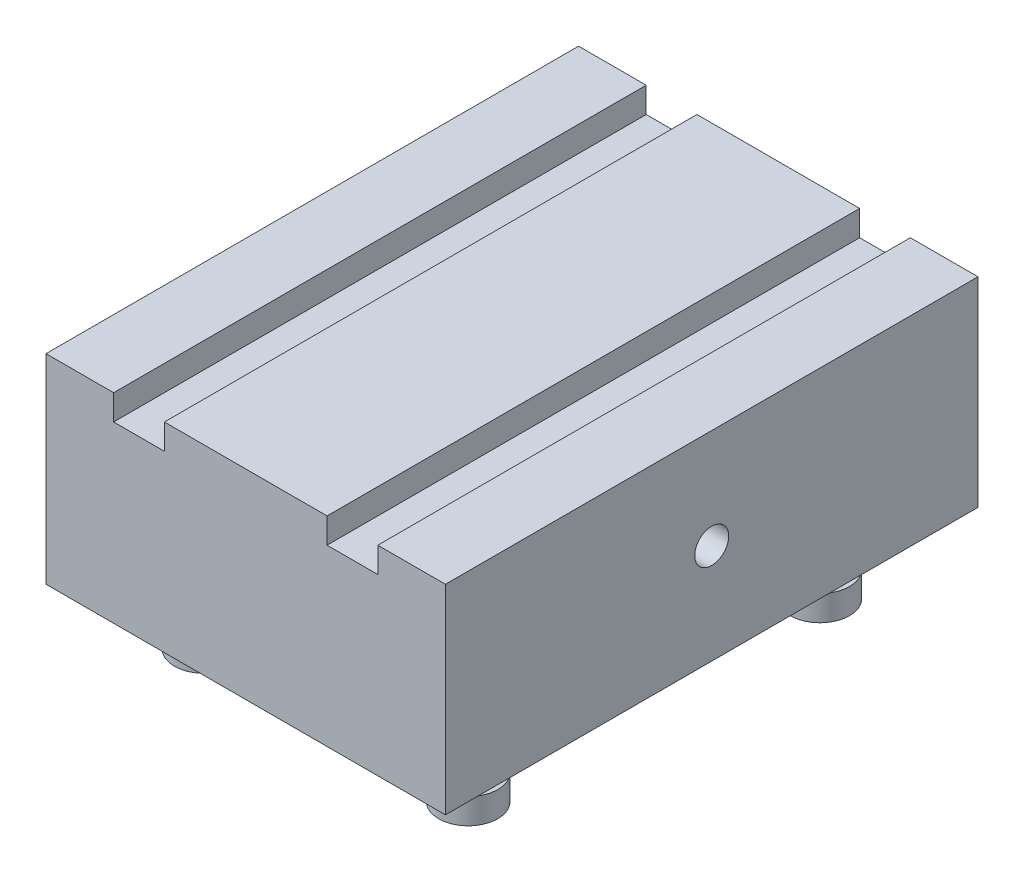
ISO-10303-21;
HEADER;
FILE_DESCRIPTION(('STEP AP214'),'2;1');
FILE_NAME('part.step','',(''),(''),'','','');
FILE_SCHEMA(('AUTOMOTIVE_DESIGN { 1 0 10303 214 1 1 1 1 }'));
ENDSEC;
DATA;
#1=APPLICATION_CONTEXT('core data for automotive mechanical design processes');
#2=APPLICATION_PROTOCOL_DEFINITION('international standard','automotive_design',2000,#1);
#3=PRODUCT_CONTEXT('',#1,'mechanical');
#4=PRODUCT('Part','Part','',(#3));
#5=PRODUCT_RELATED_PRODUCT_CATEGORY('part','',(#4));
#6=PRODUCT_DEFINITION_FORMATION('','',#4);
#7=PRODUCT_DEFINITION_CONTEXT('part definition',#1,'design');
#8=PRODUCT_DEFINITION('design','',#6,#7);
#9=PRODUCT_DEFINITION_SHAPE('','',#8);
#10=(LENGTH_UNIT() NAMED_UNIT(*) SI_UNIT(.MILLI.,.METRE.));
#11=(NAMED_UNIT(*) PLANE_ANGLE_UNIT() SI_UNIT($,.RADIAN.));
#12=(NAMED_UNIT(*) SI_UNIT($,.STERADIAN.) SOLID_ANGLE_UNIT());
#13=UNCERTAINTY_MEASURE_WITH_UNIT(LENGTH_MEASURE(1.E-05),#10,'distance_accuracy_value','');
#14=(GEOMETRIC_REPRESENTATION_CONTEXT(3) GLOBAL_UNCERTAINTY_ASSIGNED_CONTEXT((#13)) GLOBAL_UNIT_ASSIGNED_CONTEXT((#10,
#11,#12)) REPRESENTATION_CONTEXT('',''));
#15=CARTESIAN_POINT('',(0.,0.,0.));
#16=DIRECTION('',(0.,0.,1.));
#17=DIRECTION('',(1.,0.,0.));
#18=AXIS2_PLACEMENT_3D('',#15,#16,#17);
#19=CARTESIAN_POINT('',(0.,-30.,0.));
#20=DIRECTION('',(0.,0.,1.));
#21=DIRECTION('',(1.,0.,0.));
#22=AXIS2_PLACEMENT_3D('',#19,#20,#21);
#23=PLANE('',#22);
#24=DIRECTION('',(0.,-1.,0.));
#25=VECTOR('',#24,1.);
#26=CARTESIAN_POINT('',(10.16,0.,0.));
#27=LINE('',#26,#25);
#28=CARTESIAN_POINT('',(10.16,0.,0.));
#29=VERTEX_POINT('',#28);
#30=CARTESIAN_POINT('',(10.16,-3.81,0.));
#31=VERTEX_POINT('',#30);
#32=EDGE_CURVE('E150',#29,#31,#27,.T.);
#33=ORIENTED_EDGE('',*,*,#32,.F.);
#34=DIRECTION('',(1.,0.,0.));
#35=VECTOR('',#34,1.);
#36=CARTESIAN_POINT('',(0.,0.,0.));
#37=LINE('',#36,#35);
#38=CARTESIAN_POINT('',(0.,0.,0.));
#39=VERTEX_POINT('',#38);
#40=EDGE_CURVE('E202',#39,#29,#37,.T.);
#41=ORIENTED_EDGE('',*,*,#40,.F.);
#42=DIRECTION('',(0.,1.,0.));
#43=VECTOR('',#42,1.);
#44=CARTESIAN_POINT('',(0.,-30.,0.));
#45=LINE('',#44,#43);
#46=CARTESIAN_POINT('',(0.,-30.,0.));
#47=VERTEX_POINT('',#46);
#48=EDGE_CURVE('E214',#47,#39,#45,.T.);
#49=ORIENTED_EDGE('',*,*,#48,.F.);
#50=DIRECTION('',(1.,0.,0.));
#51=VECTOR('',#50,1.);
#52=CARTESIAN_POINT('',(0.,-30.,0.));
#53=LINE('',#52,#51);
#54=CARTESIAN_POINT('',(59.999999888,-30.,0.));
#55=VERTEX_POINT('',#54);
#56=EDGE_CURVE('E190',#47,#55,#53,.T.);
#57=ORIENTED_EDGE('',*,*,#56,.T.);
#58=DIRECTION('',(0.,1.,0.));
#59=VECTOR('',#58,1.);
#60=CARTESIAN_POINT('',(59.999999888,-30.,0.));
#61=LINE('',#60,#59);
#62=CARTESIAN_POINT('',(59.999999888,0.,0.));
#63=VERTEX_POINT('',#62);
#64=EDGE_CURVE('E201',#55,#63,#61,.T.);
#65=ORIENTED_EDGE('',*,*,#64,.T.);
#66=CARTESIAN_POINT('',(49.839999888,0.,0.));
#67=VERTEX_POINT('',#66);
#68=EDGE_CURVE('E164',#67,#63,#37,.T.);
#69=ORIENTED_EDGE('',*,*,#68,.F.);
#70=DIRECTION('',(0.,-1.,0.));
#71=VECTOR('',#70,1.);
#72=CARTESIAN_POINT('',(49.839999888,0.,0.));
#73=LINE('',#72,#71);
#74=CARTESIAN_POINT('',(49.839999888,-3.80999999999999,0.));
#75=VERTEX_POINT('',#74);
#76=EDGE_CURVE('E170',#67,#75,#73,.T.);
#77=ORIENTED_EDGE('',*,*,#76,.T.);
#78=DIRECTION('',(-1.,0.,0.));
#79=VECTOR('',#78,1.);
#80=CARTESIAN_POINT('',(0.,-3.81000000000001,0.));
#81=LINE('',#80,#79);
#82=CARTESIAN_POINT('',(42.219999888,-3.80999999999999,0.));
#83=VERTEX_POINT('',#82);
#84=EDGE_CURVE('E178',#75,#83,#81,.T.);
#85=ORIENTED_EDGE('',*,*,#84,.T.);
#86=DIRECTION('',(0.,1.,0.));
#87=VECTOR('',#86,1.);
#88=CARTESIAN_POINT('',(42.219999888,0.,0.));
#89=LINE('',#88,#87);
#90=CARTESIAN_POINT('',(42.219999888,0.,0.));
#91=VERTEX_POINT('',#90);
#92=EDGE_CURVE('E175',#83,#91,#89,.T.);
#93=ORIENTED_EDGE('',*,*,#92,.T.);
#94=CARTESIAN_POINT('',(17.78,0.,0.));
#95=VERTEX_POINT('',#94);
#96=EDGE_CURVE('E206',#95,#91,#37,.T.);
#97=ORIENTED_EDGE('',*,*,#96,.F.);
#98=DIRECTION('',(0.,1.,0.));
#99=VECTOR('',#98,1.);
#100=CARTESIAN_POINT('',(17.78,0.,0.));
#101=LINE('',#100,#99);
#102=CARTESIAN_POINT('',(17.78,-3.81,0.));
#103=VERTEX_POINT('',#102);
#104=EDGE_CURVE('E63',#103,#95,#101,.T.);
#105=ORIENTED_EDGE('',*,*,#104,.F.);
#106=DIRECTION('',(1.,0.,0.));
#107=VECTOR('',#106,1.);
#108=CARTESIAN_POINT('',(0.,-3.81,0.));
#109=LINE('',#108,#107);
#110=EDGE_CURVE('E137',#31,#103,#109,.T.);
#111=ORIENTED_EDGE('',*,*,#110,.F.);
#112=EDGE_LOOP('',(#33,#41,#49,#57,#65,#69,#77,#85,#93,#97,#105,#111));
#113=FACE_BOUND('',#112,.T.);
#114=ADVANCED_FACE('F39',(#113),#23,.T.);
#115=CARTESIAN_POINT('',(0.,-30.,-80.));
#116=DIRECTION('',(0.,0.,1.));
#117=DIRECTION('',(1.,0.,0.));
#118=AXIS2_PLACEMENT_3D('',#115,#116,#117);
#119=PLANE('',#118);
#120=DIRECTION('',(1.,0.,0.));
#121=VECTOR('',#120,1.);
#122=CARTESIAN_POINT('',(0.,0.,-80.));
#123=LINE('',#122,#121);
#124=CARTESIAN_POINT('',(0.,0.,-80.));
#125=VERTEX_POINT('',#124);
#126=CARTESIAN_POINT('',(10.16,0.,-80.));
#127=VERTEX_POINT('',#126);
#128=EDGE_CURVE('E210',#125,#127,#123,.T.);
#129=ORIENTED_EDGE('',*,*,#128,.T.);
#130=DIRECTION('',(0.,-1.,0.));
#131=VECTOR('',#130,1.);
#132=CARTESIAN_POINT('',(10.16,0.,-80.));
#133=LINE('',#132,#131);
#134=CARTESIAN_POINT('',(10.16,-3.81,-80.));
#135=VERTEX_POINT('',#134);
#136=EDGE_CURVE('E139',#127,#135,#133,.T.);
#137=ORIENTED_EDGE('',*,*,#136,.T.);
#138=DIRECTION('',(1.,0.,0.));
#139=VECTOR('',#138,1.);
#140=CARTESIAN_POINT('',(0.,-3.81,-80.));
#141=LINE('',#140,#139);
#142=CARTESIAN_POINT('',(17.78,-3.81,-80.));
#143=VERTEX_POINT('',#142);
#144=EDGE_CURVE('E134',#135,#143,#141,.T.);
#145=ORIENTED_EDGE('',*,*,#144,.T.);
#146=DIRECTION('',(0.,1.,0.));
#147=VECTOR('',#146,1.);
#148=CARTESIAN_POINT('',(17.78,0.,-80.));
#149=LINE('',#148,#147);
#150=CARTESIAN_POINT('',(17.78,0.,-80.));
#151=VERTEX_POINT('',#150);
#152=EDGE_CURVE('E142',#143,#151,#149,.T.);
#153=ORIENTED_EDGE('',*,*,#152,.T.);
#154=CARTESIAN_POINT('',(42.219999888,0.,-80.));
#155=VERTEX_POINT('',#154);
#156=EDGE_CURVE('E212',#151,#155,#123,.T.);
#157=ORIENTED_EDGE('',*,*,#156,.T.);
#158=DIRECTION('',(0.,1.,0.));
#159=VECTOR('',#158,1.);
#160=CARTESIAN_POINT('',(42.219999888,0.,-80.));
#161=LINE('',#160,#159);
#162=CARTESIAN_POINT('',(42.219999888,-3.80999999999999,-80.));
#163=VERTEX_POINT('',#162);
#164=EDGE_CURVE('E55',#163,#155,#161,.T.);
#165=ORIENTED_EDGE('',*,*,#164,.F.);
#166=DIRECTION('',(-1.,0.,0.));
#167=VECTOR('',#166,1.);
#168=CARTESIAN_POINT('',(0.,-3.81000000000001,-80.));
#169=LINE('',#168,#167);
#170=CARTESIAN_POINT('',(49.839999888,-3.80999999999999,-80.));
#171=VERTEX_POINT('',#170);
#172=EDGE_CURVE('E169',#171,#163,#169,.T.);
#173=ORIENTED_EDGE('',*,*,#172,.F.);
#174=DIRECTION('',(0.,-1.,0.));
#175=VECTOR('',#174,1.);
#176=CARTESIAN_POINT('',(49.839999888,0.,-80.));
#177=LINE('',#176,#175);
#178=CARTESIAN_POINT('',(49.839999888,0.,-80.));
#179=VERTEX_POINT('',#178);
#180=EDGE_CURVE('E172',#179,#171,#177,.T.);
#181=ORIENTED_EDGE('',*,*,#180,.F.);
#182=CARTESIAN_POINT('',(59.999999888,0.,-80.));
#183=VERTEX_POINT('',#182);
#184=EDGE_CURVE('E209',#179,#183,#123,.T.);
#185=ORIENTED_EDGE('',*,*,#184,.T.);
#186=DIRECTION('',(0.,1.,0.));
#187=VECTOR('',#186,1.);
#188=CARTESIAN_POINT('',(59.999999888,-30.,-80.));
#189=LINE('',#188,#187);
#190=CARTESIAN_POINT('',(59.999999888,-30.,-80.));
#191=VERTEX_POINT('',#190);
#192=EDGE_CURVE('E220',#191,#183,#189,.T.);
#193=ORIENTED_EDGE('',*,*,#192,.F.);
#194=DIRECTION('',(1.,0.,0.));
#195=VECTOR('',#194,1.);
#196=CARTESIAN_POINT('',(0.,-30.,-80.));
#197=LINE('',#196,#195);
#198=CARTESIAN_POINT('',(0.,-30.,-80.));
#199=VERTEX_POINT('',#198);
#200=EDGE_CURVE('E197',#199,#191,#197,.T.);
#201=ORIENTED_EDGE('',*,*,#200,.F.);
#202=DIRECTION('',(0.,1.,0.));
#203=VECTOR('',#202,1.);
#204=CARTESIAN_POINT('',(0.,-30.,-80.));
#205=LINE('',#204,#203);
#206=EDGE_CURVE('E217',#199,#125,#205,.T.);
#207=ORIENTED_EDGE('',*,*,#206,.T.);
#208=EDGE_LOOP('',(#129,#137,#145,#153,#157,#165,#173,#181,#185,#193,#201,#207));
#209=FACE_BOUND('',#208,.T.);
#210=ADVANCED_FACE('F149',(#209),#119,.F.);
#211=CARTESIAN_POINT('',(0.,0.,0.));
#212=DIRECTION('',(0.,1.,0.));
#213=DIRECTION('',(0.,0.,1.));
#214=AXIS2_PLACEMENT_3D('',#211,#212,#213);
#215=PLANE('',#214);
#216=DIRECTION('',(0.,0.,1.));
#217=VECTOR('',#216,1.);
#218=CARTESIAN_POINT('',(10.16,0.,-80.));
#219=LINE('',#218,#217);
#220=EDGE_CURVE('E165',#127,#29,#219,.T.);
#221=ORIENTED_EDGE('',*,*,#220,.F.);
#222=ORIENTED_EDGE('',*,*,#128,.F.);
#223=DIRECTION('',(0.,0.,-1.));
#224=VECTOR('',#223,1.);
#225=CARTESIAN_POINT('',(0.,0.,0.));
#226=LINE('',#225,#224);
#227=EDGE_CURVE('E194',#39,#125,#226,.T.);
#228=ORIENTED_EDGE('',*,*,#227,.F.);
#229=ORIENTED_EDGE('',*,*,#40,.T.);
#230=EDGE_LOOP('',(#221,#222,#228,#229));
#231=FACE_BOUND('',#230,.T.);
#232=ADVANCED_FACE('F317',(#231),#215,.T.);
#233=ORIENTED_EDGE('',*,*,#184,.F.);
#234=DIRECTION('',(0.,0.,1.));
#235=VECTOR('',#234,1.);
#236=CARTESIAN_POINT('',(49.839999888,0.,-80.));
#237=LINE('',#236,#235);
#238=EDGE_CURVE('E160',#179,#67,#237,.T.);
#239=ORIENTED_EDGE('',*,*,#238,.T.);
#240=ORIENTED_EDGE('',*,*,#68,.T.);
#241=DIRECTION('',(0.,0.,-1.));
#242=VECTOR('',#241,1.);
#243=CARTESIAN_POINT('',(59.999999888,0.,0.));
#244=LINE('',#243,#242);
#245=EDGE_CURVE('E205',#63,#183,#244,.T.);
#246=ORIENTED_EDGE('',*,*,#245,.T.);
#247=EDGE_LOOP('',(#233,#239,#240,#246));
#248=FACE_BOUND('',#247,.T.);
#249=ADVANCED_FACE('F293',(#248),#215,.T.);
#250=DIRECTION('',(0.,0.,1.));
#251=VECTOR('',#250,1.);
#252=CARTESIAN_POINT('',(17.78,0.,-80.));
#253=LINE('',#252,#251);
#254=EDGE_CURVE('E138',#151,#95,#253,.T.);
#255=ORIENTED_EDGE('',*,*,#254,.T.);
#256=ORIENTED_EDGE('',*,*,#96,.T.);
#257=DIRECTION('',(0.,0.,1.));
#258=VECTOR('',#257,1.);
#259=CARTESIAN_POINT('',(42.219999888,0.,-80.));
#260=LINE('',#259,#258);
#261=EDGE_CURVE('E174',#155,#91,#260,.T.);
#262=ORIENTED_EDGE('',*,*,#261,.F.);
#263=ORIENTED_EDGE('',*,*,#156,.F.);
#264=EDGE_LOOP('',(#255,#256,#262,#263));
#265=FACE_BOUND('',#264,.T.);
#266=ADVANCED_FACE('F297',(#265),#215,.T.);
#267=CARTESIAN_POINT('',(0.,-30.,0.));
#268=DIRECTION('',(1.,0.,0.));
#269=DIRECTION('',(0.,0.,-1.));
#270=AXIS2_PLACEMENT_3D('',#267,#268,#269);
#271=PLANE('',#270);
#272=CARTESIAN_POINT('',(0.,-15.,-40.));
#273=DIRECTION('',(1.,0.,0.));
#274=DIRECTION('',(0.,0.,-1.));
#275=AXIS2_PLACEMENT_3D('',#272,#273,#274);
#276=CIRCLE('',#275,2.55269999999998);
#277=CARTESIAN_POINT('',(0.,-15.,-42.5527));
#278=VERTEX_POINT('',#277);
#279=EDGE_CURVE('E335',#278,#278,#276,.T.);
#280=ORIENTED_EDGE('',*,*,#279,.T.);
#281=EDGE_LOOP('',(#280));
#282=FACE_BOUND('',#281,.T.);
#283=ORIENTED_EDGE('',*,*,#227,.T.);
#284=ORIENTED_EDGE('',*,*,#206,.F.);
#285=DIRECTION('',(0.,0.,-1.));
#286=VECTOR('',#285,1.);
#287=CARTESIAN_POINT('',(0.,-30.,0.));
#288=LINE('',#287,#286);
#289=EDGE_CURVE('E199',#47,#199,#288,.T.);
#290=ORIENTED_EDGE('',*,*,#289,.F.);
#291=ORIENTED_EDGE('',*,*,#48,.T.);
#292=EDGE_LOOP('',(#283,#284,#290,#291));
#293=FACE_BOUND('',#292,.T.);
#294=ADVANCED_FACE('F285',(#282,#293),#271,.F.);
#295=CARTESIAN_POINT('',(59.999999888,-30.,0.));
#296=DIRECTION('',(1.,0.,0.));
#297=DIRECTION('',(0.,0.,-1.));
#298=AXIS2_PLACEMENT_3D('',#295,#296,#297);
#299=PLANE('',#298);
#300=CARTESIAN_POINT('',(59.999999888,-15.,-40.));
#301=DIRECTION('',(1.,0.,0.));
#302=DIRECTION('',(0.,0.,-1.));
#303=AXIS2_PLACEMENT_3D('',#300,#301,#302);
#304=CIRCLE('',#303,2.5527);
#305=CARTESIAN_POINT('',(59.999999888,-15.,-42.5527));
#306=VERTEX_POINT('',#305);
#307=EDGE_CURVE('E333',#306,#306,#304,.T.);
#308=ORIENTED_EDGE('',*,*,#307,.F.);
#309=EDGE_LOOP('',(#308));
#310=FACE_BOUND('',#309,.T.);
#311=ORIENTED_EDGE('',*,*,#245,.F.);
#312=ORIENTED_EDGE('',*,*,#64,.F.);
#313=DIRECTION('',(0.,0.,-1.));
#314=VECTOR('',#313,1.);
#315=CARTESIAN_POINT('',(59.999999888,-30.,0.));
#316=LINE('',#315,#314);
#317=EDGE_CURVE('E193',#55,#191,#316,.T.);
#318=ORIENTED_EDGE('',*,*,#317,.T.);
#319=ORIENTED_EDGE('',*,*,#192,.T.);
#320=EDGE_LOOP('',(#311,#312,#318,#319));
#321=FACE_BOUND('',#320,.T.);
#322=ADVANCED_FACE('F271',(#310,#321),#299,.T.);
#323=CARTESIAN_POINT('',(0.,-30.,0.));
#324=DIRECTION('',(0.,1.,0.));
#325=DIRECTION('',(0.,0.,1.));
#326=AXIS2_PLACEMENT_3D('',#323,#324,#325);
#327=PLANE('',#326);
#328=CARTESIAN_POINT('',(10.16,-30.,-66.416));
#329=DIRECTION('',(0.,1.,0.));
#330=DIRECTION('',(0.,0.,1.));
#331=AXIS2_PLACEMENT_3D('',#328,#329,#330);
#332=CIRCLE('',#331,4.445);
#333=CARTESIAN_POINT('',(10.16,-30.,-61.971));
#334=VERTEX_POINT('',#333);
#335=EDGE_CURVE('E42',#334,#334,#332,.F.);
#336=ORIENTED_EDGE('',*,*,#335,.F.);
#337=EDGE_LOOP('',(#336));
#338=FACE_BOUND('',#337,.T.);
#339=CARTESIAN_POINT('',(49.839999888,-30.,-66.416));
#340=DIRECTION('',(0.,1.,0.));
#341=DIRECTION('',(0.,0.,1.));
#342=AXIS2_PLACEMENT_3D('',#339,#340,#341);
#343=CIRCLE('',#342,4.445);
#344=CARTESIAN_POINT('',(49.839999888,-30.,-61.971));
#345=VERTEX_POINT('',#344);
#346=EDGE_CURVE('E229',#345,#345,#343,.F.);
#347=ORIENTED_EDGE('',*,*,#346,.F.);
#348=EDGE_LOOP('',(#347));
#349=FACE_BOUND('',#348,.T.);
#350=CARTESIAN_POINT('',(10.16,-30.,-13.584));
#351=DIRECTION('',(0.,1.,0.));
#352=DIRECTION('',(0.,0.,1.));
#353=AXIS2_PLACEMENT_3D('',#350,#351,#352);
#354=CIRCLE('',#353,4.445);
#355=CARTESIAN_POINT('',(10.16,-30.,-9.13900000000001));
#356=VERTEX_POINT('',#355);
#357=EDGE_CURVE('E227',#356,#356,#354,.F.);
#358=ORIENTED_EDGE('',*,*,#357,.F.);
#359=EDGE_LOOP('',(#358));
#360=FACE_BOUND('',#359,.T.);
#361=CARTESIAN_POINT('',(49.839999888,-30.,-13.584));
#362=DIRECTION('',(0.,1.,0.));
#363=DIRECTION('',(0.,0.,1.));
#364=AXIS2_PLACEMENT_3D('',#361,#362,#363);
#365=CIRCLE('',#364,4.445);
#366=CARTESIAN_POINT('',(49.839999888,-30.,-9.139));
#367=VERTEX_POINT('',#366);
#368=EDGE_CURVE('E216',#367,#367,#365,.F.);
#369=ORIENTED_EDGE('',*,*,#368,.F.);
#370=EDGE_LOOP('',(#369));
#371=FACE_BOUND('',#370,.T.);
#372=ORIENTED_EDGE('',*,*,#56,.F.);
#373=ORIENTED_EDGE('',*,*,#289,.T.);
#374=ORIENTED_EDGE('',*,*,#200,.T.);
#375=ORIENTED_EDGE('',*,*,#317,.F.);
#376=EDGE_LOOP('',(#372,#373,#374,#375));
#377=FACE_BOUND('',#376,.T.);
#378=ADVANCED_FACE('F267',(#338,#349,#360,#371,#377),#327,.F.);
#379=CARTESIAN_POINT('',(49.839999888,0.,-80.));
#380=DIRECTION('',(-1.,0.,0.));
#381=DIRECTION('',(0.,0.,1.));
#382=AXIS2_PLACEMENT_3D('',#379,#380,#381);
#383=PLANE('',#382);
#384=ORIENTED_EDGE('',*,*,#76,.F.);
#385=ORIENTED_EDGE('',*,*,#238,.F.);
#386=ORIENTED_EDGE('',*,*,#180,.T.);
#387=DIRECTION('',(0.,0.,1.));
#388=VECTOR('',#387,1.);
#389=CARTESIAN_POINT('',(49.839999888,-3.80999999999999,-80.));
#390=LINE('',#389,#388);
#391=EDGE_CURVE('E185',#171,#75,#390,.T.);
#392=ORIENTED_EDGE('',*,*,#391,.T.);
#393=EDGE_LOOP('',(#384,#385,#386,#392));
#394=FACE_BOUND('',#393,.T.);
#395=ADVANCED_FACE('F270',(#394),#383,.T.);
#396=CARTESIAN_POINT('',(0.,-3.81000000000001,-80.));
#397=DIRECTION('',(0.,1.,0.));
#398=DIRECTION('',(-1.,0.,0.));
#399=AXIS2_PLACEMENT_3D('',#396,#397,#398);
#400=PLANE('',#399);
#401=ORIENTED_EDGE('',*,*,#84,.F.);
#402=ORIENTED_EDGE('',*,*,#391,.F.);
#403=ORIENTED_EDGE('',*,*,#172,.T.);
#404=DIRECTION('',(0.,0.,1.));
#405=VECTOR('',#404,1.);
#406=CARTESIAN_POINT('',(42.219999888,-3.80999999999999,-80.));
#407=LINE('',#406,#405);
#408=EDGE_CURVE('E187',#163,#83,#407,.T.);
#409=ORIENTED_EDGE('',*,*,#408,.T.);
#410=EDGE_LOOP('',(#401,#402,#403,#409));
#411=FACE_BOUND('',#410,.T.);
#412=ADVANCED_FACE('F304',(#411),#400,.T.);
#413=CARTESIAN_POINT('',(42.219999888,0.,-80.));
#414=DIRECTION('',(1.,0.,0.));
#415=DIRECTION('',(0.,0.,-1.));
#416=AXIS2_PLACEMENT_3D('',#413,#414,#415);
#417=PLANE('',#416);
#418=ORIENTED_EDGE('',*,*,#92,.F.);
#419=ORIENTED_EDGE('',*,*,#408,.F.);
#420=ORIENTED_EDGE('',*,*,#164,.T.);
#421=ORIENTED_EDGE('',*,*,#261,.T.);
#422=EDGE_LOOP('',(#418,#419,#420,#421));
#423=FACE_BOUND('',#422,.T.);
#424=ADVANCED_FACE('F300',(#423),#417,.T.);
#425=CARTESIAN_POINT('',(0.,-3.81,-80.));
#426=DIRECTION('',(0.,-1.,0.));
#427=DIRECTION('',(1.,0.,0.));
#428=AXIS2_PLACEMENT_3D('',#425,#426,#427);
#429=PLANE('',#428);
#430=ORIENTED_EDGE('',*,*,#110,.T.);
#431=DIRECTION('',(0.,0.,1.));
#432=VECTOR('',#431,1.);
#433=CARTESIAN_POINT('',(17.78,-3.81,-80.));
#434=LINE('',#433,#432);
#435=EDGE_CURVE('E130',#143,#103,#434,.T.);
#436=ORIENTED_EDGE('',*,*,#435,.F.);
#437=ORIENTED_EDGE('',*,*,#144,.F.);
#438=DIRECTION('',(0.,0.,1.));
#439=VECTOR('',#438,1.);
#440=CARTESIAN_POINT('',(10.16,-3.81,-80.));
#441=LINE('',#440,#439);
#442=EDGE_CURVE('E162',#135,#31,#441,.T.);
#443=ORIENTED_EDGE('',*,*,#442,.T.);
#444=EDGE_LOOP('',(#430,#436,#437,#443));
#445=FACE_BOUND('',#444,.T.);
#446=ADVANCED_FACE('F132',(#445),#429,.F.);
#447=CARTESIAN_POINT('',(10.16,0.,-80.));
#448=DIRECTION('',(-1.,0.,0.));
#449=DIRECTION('',(0.,-1.,0.));
#450=AXIS2_PLACEMENT_3D('',#447,#448,#449);
#451=PLANE('',#450);
#452=ORIENTED_EDGE('',*,*,#32,.T.);
#453=ORIENTED_EDGE('',*,*,#442,.F.);
#454=ORIENTED_EDGE('',*,*,#136,.F.);
#455=ORIENTED_EDGE('',*,*,#220,.T.);
#456=EDGE_LOOP('',(#452,#453,#454,#455));
#457=FACE_BOUND('',#456,.T.);
#458=ADVANCED_FACE('F421',(#457),#451,.F.);
#459=CARTESIAN_POINT('',(17.78,0.,-80.));
#460=DIRECTION('',(1.,0.,0.));
#461=DIRECTION('',(0.,0.,-1.));
#462=AXIS2_PLACEMENT_3D('',#459,#460,#461);
#463=PLANE('',#462);
#464=ORIENTED_EDGE('',*,*,#104,.T.);
#465=ORIENTED_EDGE('',*,*,#254,.F.);
#466=ORIENTED_EDGE('',*,*,#152,.F.);
#467=ORIENTED_EDGE('',*,*,#435,.T.);
#468=EDGE_LOOP('',(#464,#465,#466,#467));
#469=FACE_BOUND('',#468,.T.);
#470=ADVANCED_FACE('F143',(#469),#463,.F.);
#471=CARTESIAN_POINT('',(49.839999888,-33.81,-13.584));
#472=DIRECTION('',(0.,1.,0.));
#473=DIRECTION('',(0.,0.,1.));
#474=AXIS2_PLACEMENT_3D('',#471,#472,#473);
#475=CYLINDRICAL_SURFACE('',#474,4.445);
#476=CARTESIAN_POINT('',(49.839999888,-33.81,-13.584));
#477=DIRECTION('',(0.,-1.,0.));
#478=DIRECTION('',(0.,0.,-1.));
#479=AXIS2_PLACEMENT_3D('',#476,#477,#478);
#480=CIRCLE('',#479,4.445);
#481=CARTESIAN_POINT('',(49.839999888,-33.81,-18.029));
#482=VERTEX_POINT('',#481);
#483=EDGE_CURVE('E155',#482,#482,#480,.T.);
#484=ORIENTED_EDGE('',*,*,#483,.F.);
#485=EDGE_LOOP('',(#484));
#486=FACE_BOUND('',#485,.T.);
#487=ORIENTED_EDGE('',*,*,#368,.T.);
#488=EDGE_LOOP('',(#487));
#489=FACE_BOUND('',#488,.T.);
#490=ADVANCED_FACE('F261',(#486,#489),#475,.T.);
#491=CARTESIAN_POINT('',(49.839999888,-33.81,-13.584));
#492=DIRECTION('',(0.,-1.,0.));
#493=DIRECTION('',(0.,0.,-1.));
#494=AXIS2_PLACEMENT_3D('',#491,#492,#493);
#495=PLANE('',#494);
#496=CARTESIAN_POINT('',(49.839999888,-33.81,-13.584));
#497=DIRECTION('',(0.,-1.,0.));
#498=DIRECTION('',(0.,0.,-1.));
#499=AXIS2_PLACEMENT_3D('',#496,#497,#498);
#500=CIRCLE('',#499,2.54);
#501=CARTESIAN_POINT('',(49.839999888,-33.81,-16.124));
#502=VERTEX_POINT('',#501);
#503=EDGE_CURVE('E234',#502,#502,#500,.T.);
#504=ORIENTED_EDGE('',*,*,#503,.F.);
#505=EDGE_LOOP('',(#504));
#506=FACE_BOUND('',#505,.T.);
#507=ORIENTED_EDGE('',*,*,#483,.T.);
#508=EDGE_LOOP('',(#507));
#509=FACE_BOUND('',#508,.T.);
#510=ADVANCED_FACE('F259',(#506,#509),#495,.T.);
#511=CARTESIAN_POINT('',(10.16,-33.81,-13.584));
#512=DIRECTION('',(0.,1.,0.));
#513=DIRECTION('',(0.,0.,1.));
#514=AXIS2_PLACEMENT_3D('',#511,#512,#513);
#515=CYLINDRICAL_SURFACE('',#514,4.445);
#516=CARTESIAN_POINT('',(10.16,-33.81,-13.584));
#517=DIRECTION('',(0.,-1.,0.));
#518=DIRECTION('',(0.,0.,1.));
#519=AXIS2_PLACEMENT_3D('',#516,#517,#518);
#520=CIRCLE('',#519,4.445);
#521=CARTESIAN_POINT('',(10.16,-33.81,-9.13900000000001));
#522=VERTEX_POINT('',#521);
#523=EDGE_CURVE('E252',#522,#522,#520,.T.);
#524=ORIENTED_EDGE('',*,*,#523,.F.);
#525=EDGE_LOOP('',(#524));
#526=FACE_BOUND('',#525,.T.);
#527=ORIENTED_EDGE('',*,*,#357,.T.);
#528=EDGE_LOOP('',(#527));
#529=FACE_BOUND('',#528,.T.);
#530=ADVANCED_FACE('F413',(#526,#529),#515,.T.);
#531=CARTESIAN_POINT('',(10.16,-33.81,-13.584));
#532=DIRECTION('',(0.,1.,0.));
#533=DIRECTION('',(0.,0.,1.));
#534=AXIS2_PLACEMENT_3D('',#531,#532,#533);
#535=PLANE('',#534);
#536=CARTESIAN_POINT('',(10.16,-33.81,-13.584));
#537=DIRECTION('',(0.,-1.,0.));
#538=DIRECTION('',(0.,0.,1.));
#539=AXIS2_PLACEMENT_3D('',#536,#537,#538);
#540=CIRCLE('',#539,2.54);
#541=CARTESIAN_POINT('',(10.16,-33.81,-11.044));
#542=VERTEX_POINT('',#541);
#543=EDGE_CURVE('E238',#542,#542,#540,.T.);
#544=ORIENTED_EDGE('',*,*,#543,.F.);
#545=EDGE_LOOP('',(#544));
#546=FACE_BOUND('',#545,.T.);
#547=ORIENTED_EDGE('',*,*,#523,.T.);
#548=EDGE_LOOP('',(#547));
#549=FACE_BOUND('',#548,.T.);
#550=ADVANCED_FACE('F409',(#546,#549),#535,.F.);
#551=CARTESIAN_POINT('',(49.839999888,-33.81,-66.416));
#552=DIRECTION('',(0.,1.,0.));
#553=DIRECTION('',(0.,0.,1.));
#554=AXIS2_PLACEMENT_3D('',#551,#552,#553);
#555=CYLINDRICAL_SURFACE('',#554,4.445);
#556=CARTESIAN_POINT('',(49.839999888,-33.81,-66.416));
#557=DIRECTION('',(0.,-1.,0.));
#558=DIRECTION('',(0.,0.,1.));
#559=AXIS2_PLACEMENT_3D('',#556,#557,#558);
#560=CIRCLE('',#559,4.445);
#561=CARTESIAN_POINT('',(49.839999888,-33.81,-61.971));
#562=VERTEX_POINT('',#561);
#563=EDGE_CURVE('E250',#562,#562,#560,.T.);
#564=ORIENTED_EDGE('',*,*,#563,.F.);
#565=EDGE_LOOP('',(#564));
#566=FACE_BOUND('',#565,.T.);
#567=ORIENTED_EDGE('',*,*,#346,.T.);
#568=EDGE_LOOP('',(#567));
#569=FACE_BOUND('',#568,.T.);
#570=ADVANCED_FACE('F405',(#566,#569),#555,.T.);
#571=CARTESIAN_POINT('',(49.839999888,-33.81,-66.416));
#572=DIRECTION('',(0.,1.,0.));
#573=DIRECTION('',(0.,0.,1.));
#574=AXIS2_PLACEMENT_3D('',#571,#572,#573);
#575=PLANE('',#574);
#576=CARTESIAN_POINT('',(49.839999888,-33.81,-66.416));
#577=DIRECTION('',(0.,-1.,0.));
#578=DIRECTION('',(0.,0.,1.));
#579=AXIS2_PLACEMENT_3D('',#576,#577,#578);
#580=CIRCLE('',#579,2.54000000000002);
#581=CARTESIAN_POINT('',(49.839999888,-33.81,-63.876));
#582=VERTEX_POINT('',#581);
#583=EDGE_CURVE('E12',#582,#582,#580,.T.);
#584=ORIENTED_EDGE('',*,*,#583,.F.);
#585=EDGE_LOOP('',(#584));
#586=FACE_BOUND('',#585,.T.);
#587=ORIENTED_EDGE('',*,*,#563,.T.);
#588=EDGE_LOOP('',(#587));
#589=FACE_BOUND('',#588,.T.);
#590=ADVANCED_FACE('F401',(#586,#589),#575,.F.);
#591=CARTESIAN_POINT('',(10.16,-33.81,-66.416));
#592=DIRECTION('',(0.,1.,0.));
#593=DIRECTION('',(0.,0.,1.));
#594=AXIS2_PLACEMENT_3D('',#591,#592,#593);
#595=CYLINDRICAL_SURFACE('',#594,4.445);
#596=CARTESIAN_POINT('',(10.16,-33.81,-66.416));
#597=DIRECTION('',(0.,-1.,0.));
#598=DIRECTION('',(0.,0.,-1.));
#599=AXIS2_PLACEMENT_3D('',#596,#597,#598);
#600=CIRCLE('',#599,4.445);
#601=CARTESIAN_POINT('',(10.16,-33.81,-70.861));
#602=VERTEX_POINT('',#601);
#603=EDGE_CURVE('E247',#602,#602,#600,.T.);
#604=ORIENTED_EDGE('',*,*,#603,.F.);
#605=EDGE_LOOP('',(#604));
#606=FACE_BOUND('',#605,.T.);
#607=ORIENTED_EDGE('',*,*,#335,.T.);
#608=EDGE_LOOP('',(#607));
#609=FACE_BOUND('',#608,.T.);
#610=ADVANCED_FACE('F394',(#606,#609),#595,.T.);
#611=CARTESIAN_POINT('',(10.16,-33.81,-66.416));
#612=DIRECTION('',(0.,-1.,0.));
#613=DIRECTION('',(0.,0.,-1.));
#614=AXIS2_PLACEMENT_3D('',#611,#612,#613);
#615=PLANE('',#614);
#616=CARTESIAN_POINT('',(10.16,-33.81,-66.416));
#617=DIRECTION('',(0.,-1.,0.));
#618=DIRECTION('',(0.,0.,-1.));
#619=AXIS2_PLACEMENT_3D('',#616,#617,#618);
#620=CIRCLE('',#619,2.54);
#621=CARTESIAN_POINT('',(10.16,-33.81,-68.956));
#622=VERTEX_POINT('',#621);
#623=EDGE_CURVE('E47',#622,#622,#620,.T.);
#624=ORIENTED_EDGE('',*,*,#623,.F.);
#625=EDGE_LOOP('',(#624));
#626=FACE_BOUND('',#625,.T.);
#627=ORIENTED_EDGE('',*,*,#603,.T.);
#628=EDGE_LOOP('',(#627));
#629=FACE_BOUND('',#628,.T.);
#630=ADVANCED_FACE('F385',(#626,#629),#615,.T.);
#631=CARTESIAN_POINT('',(49.839999888,-36.35,-13.584));
#632=DIRECTION('',(0.,1.,0.));
#633=DIRECTION('',(0.,0.,1.));
#634=AXIS2_PLACEMENT_3D('',#631,#632,#633);
#635=CYLINDRICAL_SURFACE('',#634,2.54);
#636=CARTESIAN_POINT('',(49.839999888,-36.35,-13.584));
#637=DIRECTION('',(0.,-1.,0.));
#638=DIRECTION('',(0.,0.,-1.));
#639=AXIS2_PLACEMENT_3D('',#636,#637,#638);
#640=CIRCLE('',#639,2.54);
#641=CARTESIAN_POINT('',(49.839999888,-36.35,-16.124));
#642=VERTEX_POINT('',#641);
#643=EDGE_CURVE('E246',#642,#642,#640,.T.);
#644=ORIENTED_EDGE('',*,*,#643,.F.);
#645=EDGE_LOOP('',(#644));
#646=FACE_BOUND('',#645,.T.);
#647=ORIENTED_EDGE('',*,*,#503,.T.);
#648=EDGE_LOOP('',(#647));
#649=FACE_BOUND('',#648,.T.);
#650=ADVANCED_FACE('F382',(#646,#649),#635,.T.);
#651=CARTESIAN_POINT('',(10.16,-36.35,-13.584));
#652=DIRECTION('',(0.,1.,0.));
#653=DIRECTION('',(0.,0.,1.));
#654=AXIS2_PLACEMENT_3D('',#651,#652,#653);
#655=CYLINDRICAL_SURFACE('',#654,2.54);
#656=CARTESIAN_POINT('',(10.16,-36.35,-13.584));
#657=DIRECTION('',(0.,-1.,0.));
#658=DIRECTION('',(0.,0.,1.));
#659=AXIS2_PLACEMENT_3D('',#656,#657,#658);
#660=CIRCLE('',#659,2.54);
#661=CARTESIAN_POINT('',(10.16,-36.35,-11.044));
#662=VERTEX_POINT('',#661);
#663=EDGE_CURVE('E370',#662,#662,#660,.T.);
#664=ORIENTED_EDGE('',*,*,#663,.F.);
#665=EDGE_LOOP('',(#664));
#666=FACE_BOUND('',#665,.T.);
#667=ORIENTED_EDGE('',*,*,#543,.T.);
#668=EDGE_LOOP('',(#667));
#669=FACE_BOUND('',#668,.T.);
#670=ADVANCED_FACE('F384',(#666,#669),#655,.T.);
#671=CARTESIAN_POINT('',(10.16,-36.35,-66.416));
#672=DIRECTION('',(0.,1.,0.));
#673=DIRECTION('',(0.,0.,1.));
#674=AXIS2_PLACEMENT_3D('',#671,#672,#673);
#675=CYLINDRICAL_SURFACE('',#674,2.54);
#676=CARTESIAN_POINT('',(10.16,-36.35,-66.416));
#677=DIRECTION('',(0.,-1.,0.));
#678=DIRECTION('',(0.,0.,-1.));
#679=AXIS2_PLACEMENT_3D('',#676,#677,#678);
#680=CIRCLE('',#679,2.54);
#681=CARTESIAN_POINT('',(10.16,-36.35,-68.956));
#682=VERTEX_POINT('',#681);
#683=EDGE_CURVE('E366',#682,#682,#680,.T.);
#684=ORIENTED_EDGE('',*,*,#683,.F.);
#685=EDGE_LOOP('',(#684));
#686=FACE_BOUND('',#685,.T.);
#687=ORIENTED_EDGE('',*,*,#623,.T.);
#688=EDGE_LOOP('',(#687));
#689=FACE_BOUND('',#688,.T.);
#690=ADVANCED_FACE('F391',(#686,#689),#675,.T.);
#691=CARTESIAN_POINT('',(49.839999888,-36.35,-66.416));
#692=DIRECTION('',(0.,1.,0.));
#693=DIRECTION('',(0.,0.,1.));
#694=AXIS2_PLACEMENT_3D('',#691,#692,#693);
#695=CYLINDRICAL_SURFACE('',#694,2.54000000000002);
#696=CARTESIAN_POINT('',(49.839999888,-36.35,-66.416));
#697=DIRECTION('',(0.,-1.,0.));
#698=DIRECTION('',(0.,0.,1.));
#699=AXIS2_PLACEMENT_3D('',#696,#697,#698);
#700=CIRCLE('',#699,2.54000000000002);
#701=CARTESIAN_POINT('',(49.839999888,-36.35,-63.876));
#702=VERTEX_POINT('',#701);
#703=EDGE_CURVE('E362',#702,#702,#700,.T.);
#704=ORIENTED_EDGE('',*,*,#703,.F.);
#705=EDGE_LOOP('',(#704));
#706=FACE_BOUND('',#705,.T.);
#707=ORIENTED_EDGE('',*,*,#583,.T.);
#708=EDGE_LOOP('',(#707));
#709=FACE_BOUND('',#708,.T.);
#710=ADVANCED_FACE('F591',(#706,#709),#695,.T.);
#711=CARTESIAN_POINT('',(10.16,-40.16,-13.584));
#712=DIRECTION('',(0.,1.,0.));
#713=DIRECTION('',(0.,0.,1.));
#714=AXIS2_PLACEMENT_3D('',#711,#712,#713);
#715=CYLINDRICAL_SURFACE('',#714,4.445);
#716=CARTESIAN_POINT('',(10.16,-40.16,-13.584));
#717=DIRECTION('',(0.,-1.,0.));
#718=DIRECTION('',(0.,0.,-1.));
#719=AXIS2_PLACEMENT_3D('',#716,#717,#718);
#720=CIRCLE('',#719,4.445);
#721=CARTESIAN_POINT('',(10.16,-40.16,-18.029));
#722=VERTEX_POINT('',#721);
#723=EDGE_CURVE('E359',#722,#722,#720,.T.);
#724=ORIENTED_EDGE('',*,*,#723,.F.);
#725=EDGE_LOOP('',(#724));
#726=FACE_BOUND('',#725,.T.);
#727=CARTESIAN_POINT('',(10.16,-36.35,-13.584));
#728=DIRECTION('',(0.,-1.,0.));
#729=DIRECTION('',(0.,0.,-1.));
#730=AXIS2_PLACEMENT_3D('',#727,#728,#729);
#731=CIRCLE('',#730,4.445);
#732=CARTESIAN_POINT('',(10.16,-36.35,-18.029));
#733=VERTEX_POINT('',#732);
#734=EDGE_CURVE('E356',#733,#733,#731,.T.);
#735=ORIENTED_EDGE('',*,*,#734,.T.);
#736=EDGE_LOOP('',(#735));
#737=FACE_BOUND('',#736,.T.);
#738=ADVANCED_FACE('F583',(#726,#737),#715,.T.);
#739=CARTESIAN_POINT('',(10.16,-40.16,-13.584));
#740=DIRECTION('',(0.,-1.,0.));
#741=DIRECTION('',(0.,0.,-1.));
#742=AXIS2_PLACEMENT_3D('',#739,#740,#741);
#743=PLANE('',#742);
#744=ORIENTED_EDGE('',*,*,#723,.T.);
#745=EDGE_LOOP('',(#744));
#746=FACE_BOUND('',#745,.T.);
#747=ADVANCED_FACE('F576',(#746),#743,.T.);
#748=CARTESIAN_POINT('',(10.16,-36.35,-13.584));
#749=DIRECTION('',(0.,-1.,0.));
#750=DIRECTION('',(0.,0.,-1.));
#751=AXIS2_PLACEMENT_3D('',#748,#749,#750);
#752=PLANE('',#751);
#753=ORIENTED_EDGE('',*,*,#663,.T.);
#754=EDGE_LOOP('',(#753));
#755=FACE_BOUND('',#754,.T.);
#756=ORIENTED_EDGE('',*,*,#734,.F.);
#757=EDGE_LOOP('',(#756));
#758=FACE_BOUND('',#757,.T.);
#759=ADVANCED_FACE('F568',(#755,#758),#752,.F.);
#760=CARTESIAN_POINT('',(10.16,-40.16,-66.416));
#761=DIRECTION('',(0.,1.,0.));
#762=DIRECTION('',(0.,0.,1.));
#763=AXIS2_PLACEMENT_3D('',#760,#761,#762);
#764=CYLINDRICAL_SURFACE('',#763,4.445);
#765=CARTESIAN_POINT('',(10.16,-40.16,-66.416));
#766=DIRECTION('',(0.,-1.,0.));
#767=DIRECTION('',(0.,0.,1.));
#768=AXIS2_PLACEMENT_3D('',#765,#766,#767);
#769=CIRCLE('',#768,4.445);
#770=CARTESIAN_POINT('',(10.16,-40.16,-61.971));
#771=VERTEX_POINT('',#770);
#772=EDGE_CURVE('E353',#771,#771,#769,.T.);
#773=ORIENTED_EDGE('',*,*,#772,.F.);
#774=EDGE_LOOP('',(#773));
#775=FACE_BOUND('',#774,.T.);
#776=CARTESIAN_POINT('',(10.16,-36.35,-66.416));
#777=DIRECTION('',(0.,-1.,0.));
#778=DIRECTION('',(0.,0.,1.));
#779=AXIS2_PLACEMENT_3D('',#776,#777,#778);
#780=CIRCLE('',#779,4.445);
#781=CARTESIAN_POINT('',(10.16,-36.35,-61.971));
#782=VERTEX_POINT('',#781);
#783=EDGE_CURVE('E350',#782,#782,#780,.T.);
#784=ORIENTED_EDGE('',*,*,#783,.T.);
#785=EDGE_LOOP('',(#784));
#786=FACE_BOUND('',#785,.T.);
#787=ADVANCED_FACE('F560',(#775,#786),#764,.T.);
#788=CARTESIAN_POINT('',(10.16,-40.16,-66.416));
#789=DIRECTION('',(0.,1.,0.));
#790=DIRECTION('',(0.,0.,1.));
#791=AXIS2_PLACEMENT_3D('',#788,#789,#790);
#792=PLANE('',#791);
#793=ORIENTED_EDGE('',*,*,#772,.T.);
#794=EDGE_LOOP('',(#793));
#795=FACE_BOUND('',#794,.T.);
#796=ADVANCED_FACE('F552',(#795),#792,.F.);
#797=CARTESIAN_POINT('',(10.16,-36.35,-66.416));
#798=DIRECTION('',(0.,1.,0.));
#799=DIRECTION('',(0.,0.,1.));
#800=AXIS2_PLACEMENT_3D('',#797,#798,#799);
#801=PLANE('',#800);
#802=ORIENTED_EDGE('',*,*,#683,.T.);
#803=EDGE_LOOP('',(#802));
#804=FACE_BOUND('',#803,.T.);
#805=ORIENTED_EDGE('',*,*,#783,.F.);
#806=EDGE_LOOP('',(#805));
#807=FACE_BOUND('',#806,.T.);
#808=ADVANCED_FACE('F544',(#804,#807),#801,.T.);
#809=CARTESIAN_POINT('',(49.839999888,-40.16,-66.416));
#810=DIRECTION('',(0.,1.,0.));
#811=DIRECTION('',(0.,0.,1.));
#812=AXIS2_PLACEMENT_3D('',#809,#810,#811);
#813=CYLINDRICAL_SURFACE('',#812,4.445);
#814=CARTESIAN_POINT('',(49.839999888,-40.16,-66.416));
#815=DIRECTION('',(0.,-1.,0.));
#816=DIRECTION('',(0.,0.,-1.));
#817=AXIS2_PLACEMENT_3D('',#814,#815,#816);
#818=CIRCLE('',#817,4.445);
#819=CARTESIAN_POINT('',(49.839999888,-40.16,-70.861));
#820=VERTEX_POINT('',#819);
#821=EDGE_CURVE('E347',#820,#820,#818,.T.);
#822=ORIENTED_EDGE('',*,*,#821,.F.);
#823=EDGE_LOOP('',(#822));
#824=FACE_BOUND('',#823,.T.);
#825=CARTESIAN_POINT('',(49.839999888,-36.35,-66.416));
#826=DIRECTION('',(0.,-1.,0.));
#827=DIRECTION('',(0.,0.,-1.));
#828=AXIS2_PLACEMENT_3D('',#825,#826,#827);
#829=CIRCLE('',#828,4.445);
#830=CARTESIAN_POINT('',(49.839999888,-36.35,-70.861));
#831=VERTEX_POINT('',#830);
#832=EDGE_CURVE('E344',#831,#831,#829,.T.);
#833=ORIENTED_EDGE('',*,*,#832,.T.);
#834=EDGE_LOOP('',(#833));
#835=FACE_BOUND('',#834,.T.);
#836=ADVANCED_FACE('F536',(#824,#835),#813,.T.);
#837=CARTESIAN_POINT('',(49.839999888,-40.16,-66.416));
#838=DIRECTION('',(0.,-1.,0.));
#839=DIRECTION('',(0.,0.,-1.));
#840=AXIS2_PLACEMENT_3D('',#837,#838,#839);
#841=PLANE('',#840);
#842=ORIENTED_EDGE('',*,*,#821,.T.);
#843=EDGE_LOOP('',(#842));
#844=FACE_BOUND('',#843,.T.);
#845=ADVANCED_FACE('F528',(#844),#841,.T.);
#846=CARTESIAN_POINT('',(49.839999888,-36.35,-66.416));
#847=DIRECTION('',(0.,-1.,0.));
#848=DIRECTION('',(0.,0.,-1.));
#849=AXIS2_PLACEMENT_3D('',#846,#847,#848);
#850=PLANE('',#849);
#851=ORIENTED_EDGE('',*,*,#703,.T.);
#852=EDGE_LOOP('',(#851));
#853=FACE_BOUND('',#852,.T.);
#854=ORIENTED_EDGE('',*,*,#832,.F.);
#855=EDGE_LOOP('',(#854));
#856=FACE_BOUND('',#855,.T.);
#857=ADVANCED_FACE('F520',(#853,#856),#850,.F.);
#858=CARTESIAN_POINT('',(49.839999888,-40.16,-13.584));
#859=DIRECTION('',(0.,1.,0.));
#860=DIRECTION('',(0.,0.,1.));
#861=AXIS2_PLACEMENT_3D('',#858,#859,#860);
#862=CYLINDRICAL_SURFACE('',#861,4.445);
#863=CARTESIAN_POINT('',(49.839999888,-40.16,-13.584));
#864=DIRECTION('',(0.,-1.,0.));
#865=DIRECTION('',(0.,0.,1.));
#866=AXIS2_PLACEMENT_3D('',#863,#864,#865);
#867=CIRCLE('',#866,4.445);
#868=CARTESIAN_POINT('',(49.839999888,-40.16,-9.139));
#869=VERTEX_POINT('',#868);
#870=EDGE_CURVE('E341',#869,#869,#867,.T.);
#871=ORIENTED_EDGE('',*,*,#870,.F.);
#872=EDGE_LOOP('',(#871));
#873=FACE_BOUND('',#872,.T.);
#874=CARTESIAN_POINT('',(49.839999888,-36.35,-13.584));
#875=DIRECTION('',(0.,-1.,0.));
#876=DIRECTION('',(0.,0.,1.));
#877=AXIS2_PLACEMENT_3D('',#874,#875,#876);
#878=CIRCLE('',#877,4.445);
#879=CARTESIAN_POINT('',(49.839999888,-36.35,-9.139));
#880=VERTEX_POINT('',#879);
#881=EDGE_CURVE('E338',#880,#880,#878,.T.);
#882=ORIENTED_EDGE('',*,*,#881,.T.);
#883=EDGE_LOOP('',(#882));
#884=FACE_BOUND('',#883,.T.);
#885=ADVANCED_FACE('F512',(#873,#884),#862,.T.);
#886=CARTESIAN_POINT('',(49.839999888,-40.16,-13.584));
#887=DIRECTION('',(0.,1.,0.));
#888=DIRECTION('',(0.,0.,1.));
#889=AXIS2_PLACEMENT_3D('',#886,#887,#888);
#890=PLANE('',#889);
#891=ORIENTED_EDGE('',*,*,#870,.T.);
#892=EDGE_LOOP('',(#891));
#893=FACE_BOUND('',#892,.T.);
#894=ADVANCED_FACE('F508',(#893),#890,.F.);
#895=CARTESIAN_POINT('',(49.839999888,-36.35,-13.584));
#896=DIRECTION('',(0.,1.,0.));
#897=DIRECTION('',(0.,0.,1.));
#898=AXIS2_PLACEMENT_3D('',#895,#896,#897);
#899=PLANE('',#898);
#900=ORIENTED_EDGE('',*,*,#643,.T.);
#901=EDGE_LOOP('',(#900));
#902=FACE_BOUND('',#901,.T.);
#903=ORIENTED_EDGE('',*,*,#881,.F.);
#904=EDGE_LOOP('',(#903));
#905=FACE_BOUND('',#904,.T.);
#906=ADVANCED_FACE('F379',(#902,#905),#899,.T.);
#907=CARTESIAN_POINT('',(59.999999888,-15.,-40.));
#908=DIRECTION('',(1.,0.,0.));
#909=DIRECTION('',(0.,0.,-1.));
#910=AXIS2_PLACEMENT_3D('',#907,#908,#909);
#911=CYLINDRICAL_SURFACE('',#910,2.55269999999999);
#912=ORIENTED_EDGE('',*,*,#279,.F.);
#913=EDGE_LOOP('',(#912));
#914=FACE_BOUND('',#913,.T.);
#915=ORIENTED_EDGE('',*,*,#307,.T.);
#916=EDGE_LOOP('',(#915));
#917=FACE_BOUND('',#916,.T.);
#918=ADVANCED_FACE('F494',(#914,#917),#911,.F.);
#919=CLOSED_SHELL('',(#114,#210,#232,#249,#266,#294,#322,#378,#395,#412,#424,#446,#458,#470,
#490,#510,#530,#550,#570,#590,#610,#630,#650,#670,#690,#710,#738,#747,#759,#787,#796,#808,#836,
#845,#857,#885,#894,#906,#918));
#920=MANIFOLD_SOLID_BREP('B2',#919);
#921=ADVANCED_BREP_SHAPE_REPRESENTATION('',(#18,#920),#14);
#922=SHAPE_DEFINITION_REPRESENTATION(#9,#921);
ENDSEC;
END-ISO-10303-21;
